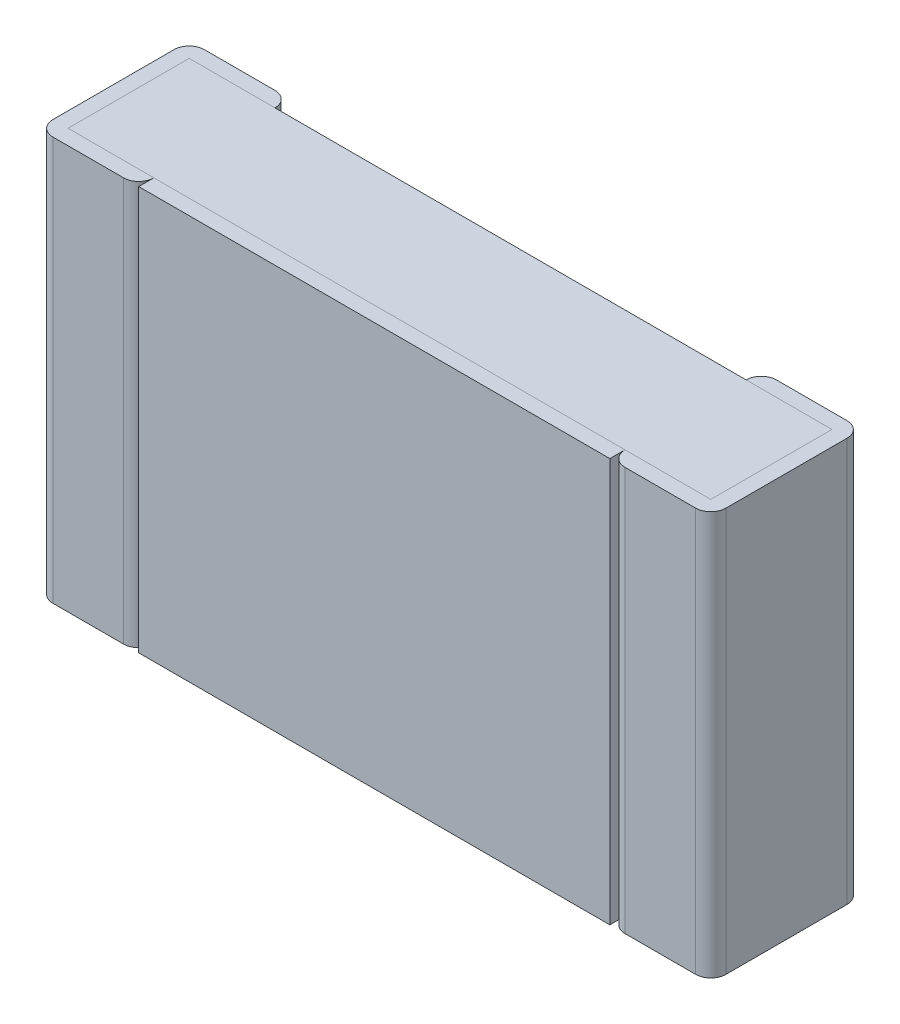
ISO-10303-21;
HEADER;
FILE_DESCRIPTION(('STEP AP214'),'2;1');
FILE_NAME('part.step','',(''),(''),'','','');
FILE_SCHEMA(('AUTOMOTIVE_DESIGN { 1 0 10303 214 1 1 1 1 }'));
ENDSEC;
DATA;
#1=APPLICATION_CONTEXT('core data for automotive mechanical design processes');
#2=APPLICATION_PROTOCOL_DEFINITION('international standard','automotive_design',2000,#1);
#3=PRODUCT_CONTEXT('',#1,'mechanical');
#4=PRODUCT('Part','Part','',(#3));
#5=PRODUCT_RELATED_PRODUCT_CATEGORY('part','',(#4));
#6=PRODUCT_DEFINITION_FORMATION('','',#4);
#7=PRODUCT_DEFINITION_CONTEXT('part definition',#1,'design');
#8=PRODUCT_DEFINITION('design','',#6,#7);
#9=PRODUCT_DEFINITION_SHAPE('','',#8);
#10=(LENGTH_UNIT() NAMED_UNIT(*) SI_UNIT(.MILLI.,.METRE.));
#11=(NAMED_UNIT(*) PLANE_ANGLE_UNIT() SI_UNIT($,.RADIAN.));
#12=(NAMED_UNIT(*) SI_UNIT($,.STERADIAN.) SOLID_ANGLE_UNIT());
#13=UNCERTAINTY_MEASURE_WITH_UNIT(LENGTH_MEASURE(1.E-05),#10,'distance_accuracy_value','');
#14=(GEOMETRIC_REPRESENTATION_CONTEXT(3) GLOBAL_UNCERTAINTY_ASSIGNED_CONTEXT((#13)) GLOBAL_UNIT_ASSIGNED_CONTEXT((#10,
#11,#12)) REPRESENTATION_CONTEXT('',''));
#15=CARTESIAN_POINT('',(0.,0.,0.));
#16=DIRECTION('',(0.,0.,1.));
#17=DIRECTION('',(1.,0.,0.));
#18=AXIS2_PLACEMENT_3D('',#15,#16,#17);
#19=CARTESIAN_POINT('',(-1.,-0.6,0.));
#20=DIRECTION('',(1.,0.,0.));
#21=DIRECTION('',(0.,1.,0.));
#22=AXIS2_PLACEMENT_3D('',#19,#20,#21);
#23=PLANE('',#22);
#24=DIRECTION('',(0.,1.,0.));
#25=VECTOR('',#24,1.);
#26=CARTESIAN_POINT('',(-1.,-0.6,0.405));
#27=LINE('',#26,#25);
#28=CARTESIAN_POINT('',(-1.,-0.6,0.405));
#29=VERTEX_POINT('',#28);
#30=CARTESIAN_POINT('',(-1.,0.6,0.405));
#31=VERTEX_POINT('',#30);
#32=EDGE_CURVE('E11',#29,#31,#27,.T.);
#33=ORIENTED_EDGE('',*,*,#32,.T.);
#34=DIRECTION('',(0.,0.,1.));
#35=VECTOR('',#34,1.);
#36=CARTESIAN_POINT('',(-1.,0.6,0.));
#37=LINE('',#36,#35);
#38=CARTESIAN_POINT('',(-1.,0.6,0.045));
#39=VERTEX_POINT('',#38);
#40=EDGE_CURVE('E41',#39,#31,#37,.T.);
#41=ORIENTED_EDGE('',*,*,#40,.F.);
#42=DIRECTION('',(0.,1.,0.));
#43=VECTOR('',#42,1.);
#44=CARTESIAN_POINT('',(-1.,-0.6,0.045));
#45=LINE('',#44,#43);
#46=CARTESIAN_POINT('',(-1.,-0.6,0.045));
#47=VERTEX_POINT('',#46);
#48=EDGE_CURVE('E122',#47,#39,#45,.T.);
#49=ORIENTED_EDGE('',*,*,#48,.F.);
#50=DIRECTION('',(0.,0.,1.));
#51=VECTOR('',#50,1.);
#52=CARTESIAN_POINT('',(-1.,-0.6,0.));
#53=LINE('',#52,#51);
#54=EDGE_CURVE('E27',#47,#29,#53,.T.);
#55=ORIENTED_EDGE('',*,*,#54,.T.);
#56=EDGE_LOOP('',(#33,#41,#49,#55));
#57=FACE_BOUND('',#56,.T.);
#58=ADVANCED_FACE('F16',(#57),#23,.F.);
#59=CARTESIAN_POINT('',(-1.,-0.6,0.));
#60=DIRECTION('',(0.,1.,0.));
#61=DIRECTION('',(1.,0.,0.));
#62=AXIS2_PLACEMENT_3D('',#59,#60,#61);
#63=PLANE('',#62);
#64=CARTESIAN_POINT('',(-0.745,-0.6,0.045));
#65=DIRECTION('',(0.,1.,0.));
#66=DIRECTION('',(0.,0.,1.));
#67=AXIS2_PLACEMENT_3D('',#64,#65,#66);
#68=CIRCLE('',#67,0.045);
#69=CARTESIAN_POINT('',(-0.7,-0.6,0.045));
#70=VERTEX_POINT('',#69);
#71=CARTESIAN_POINT('',(-0.745,-0.6,0.));
#72=VERTEX_POINT('',#71);
#73=EDGE_CURVE('E370',#70,#72,#68,.T.);
#74=ORIENTED_EDGE('',*,*,#73,.F.);
#75=DIRECTION('',(1.,0.,0.));
#76=VECTOR('',#75,1.);
#77=CARTESIAN_POINT('',(-0.955,-0.6,0.045));
#78=LINE('',#77,#76);
#79=CARTESIAN_POINT('',(-0.955,-0.6,0.045));
#80=VERTEX_POINT('',#79);
#81=EDGE_CURVE('E295',#80,#70,#78,.T.);
#82=ORIENTED_EDGE('',*,*,#81,.F.);
#83=DIRECTION('',(0.,0.,1.));
#84=VECTOR('',#83,1.);
#85=CARTESIAN_POINT('',(-0.955,-0.6,0.045));
#86=LINE('',#85,#84);
#87=CARTESIAN_POINT('',(-0.955,-0.6,0.405));
#88=VERTEX_POINT('',#87);
#89=EDGE_CURVE('E327',#80,#88,#86,.T.);
#90=ORIENTED_EDGE('',*,*,#89,.T.);
#91=DIRECTION('',(1.,0.,0.));
#92=VECTOR('',#91,1.);
#93=CARTESIAN_POINT('',(-0.955,-0.6,0.405));
#94=LINE('',#93,#92);
#95=CARTESIAN_POINT('',(-0.7,-0.6,0.405));
#96=VERTEX_POINT('',#95);
#97=EDGE_CURVE('E273',#88,#96,#94,.T.);
#98=ORIENTED_EDGE('',*,*,#97,.T.);
#99=CARTESIAN_POINT('',(-0.745,-0.6,0.405));
#100=DIRECTION('',(0.,-1.,0.));
#101=DIRECTION('',(0.,0.,1.));
#102=AXIS2_PLACEMENT_3D('',#99,#100,#101);
#103=CIRCLE('',#102,0.045);
#104=CARTESIAN_POINT('',(-0.745,-0.6,0.45));
#105=VERTEX_POINT('',#104);
#106=EDGE_CURVE('E269',#96,#105,#103,.T.);
#107=ORIENTED_EDGE('',*,*,#106,.T.);
#108=DIRECTION('',(1.,0.,0.));
#109=VECTOR('',#108,1.);
#110=CARTESIAN_POINT('',(-1.,-0.6,0.45));
#111=LINE('',#110,#109);
#112=CARTESIAN_POINT('',(-0.955,-0.6,0.45));
#113=VERTEX_POINT('',#112);
#114=EDGE_CURVE('E299',#113,#105,#111,.T.);
#115=ORIENTED_EDGE('',*,*,#114,.F.);
#116=CARTESIAN_POINT('',(-0.955,-0.6,0.405));
#117=DIRECTION('',(0.,1.,0.));
#118=DIRECTION('',(0.,0.,1.));
#119=AXIS2_PLACEMENT_3D('',#116,#117,#118);
#120=CIRCLE('',#119,0.045);
#121=EDGE_CURVE('E289',#29,#113,#120,.T.);
#122=ORIENTED_EDGE('',*,*,#121,.F.);
#123=ORIENTED_EDGE('',*,*,#54,.F.);
#124=CARTESIAN_POINT('',(-0.955,-0.6,0.045));
#125=DIRECTION('',(0.,-1.,0.));
#126=DIRECTION('',(0.,0.,1.));
#127=AXIS2_PLACEMENT_3D('',#124,#125,#126);
#128=CIRCLE('',#127,0.045);
#129=CARTESIAN_POINT('',(-0.955,-0.6,0.));
#130=VERTEX_POINT('',#129);
#131=EDGE_CURVE('E274',#47,#130,#128,.T.);
#132=ORIENTED_EDGE('',*,*,#131,.T.);
#133=DIRECTION('',(1.,0.,0.));
#134=VECTOR('',#133,1.);
#135=CARTESIAN_POINT('',(-1.,-0.6,0.));
#136=LINE('',#135,#134);
#137=EDGE_CURVE('E317',#130,#72,#136,.T.);
#138=ORIENTED_EDGE('',*,*,#137,.T.);
#139=EDGE_LOOP('',(#74,#82,#90,#98,#107,#115,#122,#123,#132,#138));
#140=FACE_BOUND('',#139,.T.);
#141=ADVANCED_FACE('F529',(#140),#63,.F.);
#142=CARTESIAN_POINT('',(-0.955,-0.6,0.045));
#143=DIRECTION('',(0.,1.,0.));
#144=DIRECTION('',(-1.,0.,0.));
#145=AXIS2_PLACEMENT_3D('',#142,#143,#144);
#146=CYLINDRICAL_SURFACE('',#145,0.045);
#147=ORIENTED_EDGE('',*,*,#48,.T.);
#148=CARTESIAN_POINT('',(-0.955,0.6,0.045));
#149=DIRECTION('',(0.,-1.,0.));
#150=DIRECTION('',(0.,0.,1.));
#151=AXIS2_PLACEMENT_3D('',#148,#149,#150);
#152=CIRCLE('',#151,0.045);
#153=CARTESIAN_POINT('',(-0.955,0.6,0.));
#154=VERTEX_POINT('',#153);
#155=EDGE_CURVE('E293',#39,#154,#152,.T.);
#156=ORIENTED_EDGE('',*,*,#155,.T.);
#157=DIRECTION('',(0.,1.,0.));
#158=VECTOR('',#157,1.);
#159=CARTESIAN_POINT('',(-0.955,-0.6,0.));
#160=LINE('',#159,#158);
#161=EDGE_CURVE('E328',#130,#154,#160,.T.);
#162=ORIENTED_EDGE('',*,*,#161,.F.);
#163=ORIENTED_EDGE('',*,*,#131,.F.);
#164=EDGE_LOOP('',(#147,#156,#162,#163));
#165=FACE_BOUND('',#164,.T.);
#166=ADVANCED_FACE('F18',(#165),#146,.T.);
#167=CARTESIAN_POINT('',(-0.955,-0.6,0.405));
#168=DIRECTION('',(0.,1.,0.));
#169=DIRECTION('',(-1.,0.,0.));
#170=AXIS2_PLACEMENT_3D('',#167,#168,#169);
#171=CYLINDRICAL_SURFACE('',#170,0.045);
#172=ORIENTED_EDGE('',*,*,#121,.T.);
#173=DIRECTION('',(0.,1.,0.));
#174=VECTOR('',#173,1.);
#175=CARTESIAN_POINT('',(-0.955,-0.6,0.45));
#176=LINE('',#175,#174);
#177=CARTESIAN_POINT('',(-0.955,0.6,0.45));
#178=VERTEX_POINT('',#177);
#179=EDGE_CURVE('E294',#113,#178,#176,.T.);
#180=ORIENTED_EDGE('',*,*,#179,.T.);
#181=CARTESIAN_POINT('',(-0.955,0.6,0.405));
#182=DIRECTION('',(0.,1.,0.));
#183=DIRECTION('',(0.,0.,1.));
#184=AXIS2_PLACEMENT_3D('',#181,#182,#183);
#185=CIRCLE('',#184,0.045);
#186=EDGE_CURVE('E300',#31,#178,#185,.T.);
#187=ORIENTED_EDGE('',*,*,#186,.F.);
#188=ORIENTED_EDGE('',*,*,#32,.F.);
#189=EDGE_LOOP('',(#172,#180,#187,#188));
#190=FACE_BOUND('',#189,.T.);
#191=ADVANCED_FACE('F532',(#190),#171,.T.);
#192=CARTESIAN_POINT('',(-1.,0.6,0.));
#193=DIRECTION('',(0.,1.,0.));
#194=DIRECTION('',(1.,0.,0.));
#195=AXIS2_PLACEMENT_3D('',#192,#193,#194);
#196=PLANE('',#195);
#197=DIRECTION('',(1.,0.,0.));
#198=VECTOR('',#197,1.);
#199=CARTESIAN_POINT('',(-1.,0.6,0.));
#200=LINE('',#199,#198);
#201=CARTESIAN_POINT('',(-0.745,0.6,0.));
#202=VERTEX_POINT('',#201);
#203=EDGE_CURVE('E333',#154,#202,#200,.T.);
#204=ORIENTED_EDGE('',*,*,#203,.F.);
#205=ORIENTED_EDGE('',*,*,#155,.F.);
#206=ORIENTED_EDGE('',*,*,#40,.T.);
#207=ORIENTED_EDGE('',*,*,#186,.T.);
#208=DIRECTION('',(1.,0.,0.));
#209=VECTOR('',#208,1.);
#210=CARTESIAN_POINT('',(-1.,0.6,0.45));
#211=LINE('',#210,#209);
#212=CARTESIAN_POINT('',(-0.745,0.6,0.45));
#213=VERTEX_POINT('',#212);
#214=EDGE_CURVE('E303',#178,#213,#211,.T.);
#215=ORIENTED_EDGE('',*,*,#214,.T.);
#216=CARTESIAN_POINT('',(-0.745,0.6,0.405));
#217=DIRECTION('',(0.,-1.,0.));
#218=DIRECTION('',(0.,0.,1.));
#219=AXIS2_PLACEMENT_3D('',#216,#217,#218);
#220=CIRCLE('',#219,0.045);
#221=CARTESIAN_POINT('',(-0.7,0.6,0.405));
#222=VERTEX_POINT('',#221);
#223=EDGE_CURVE('E275',#222,#213,#220,.T.);
#224=ORIENTED_EDGE('',*,*,#223,.F.);
#225=DIRECTION('',(1.,0.,0.));
#226=VECTOR('',#225,1.);
#227=CARTESIAN_POINT('',(-0.955,0.6,0.405));
#228=LINE('',#227,#226);
#229=CARTESIAN_POINT('',(-0.955,0.6,0.405));
#230=VERTEX_POINT('',#229);
#231=EDGE_CURVE('E352',#230,#222,#228,.T.);
#232=ORIENTED_EDGE('',*,*,#231,.F.);
#233=DIRECTION('',(0.,0.,1.));
#234=VECTOR('',#233,1.);
#235=CARTESIAN_POINT('',(-0.955,0.6,0.045));
#236=LINE('',#235,#234);
#237=CARTESIAN_POINT('',(-0.955,0.6,0.045));
#238=VERTEX_POINT('',#237);
#239=EDGE_CURVE('E279',#238,#230,#236,.T.);
#240=ORIENTED_EDGE('',*,*,#239,.F.);
#241=DIRECTION('',(1.,0.,0.));
#242=VECTOR('',#241,1.);
#243=CARTESIAN_POINT('',(-0.955,0.6,0.045));
#244=LINE('',#243,#242);
#245=CARTESIAN_POINT('',(-0.7,0.6,0.045));
#246=VERTEX_POINT('',#245);
#247=EDGE_CURVE('E334',#238,#246,#244,.T.);
#248=ORIENTED_EDGE('',*,*,#247,.T.);
#249=CARTESIAN_POINT('',(-0.745,0.6,0.045));
#250=DIRECTION('',(0.,1.,0.));
#251=DIRECTION('',(0.,0.,1.));
#252=AXIS2_PLACEMENT_3D('',#249,#250,#251);
#253=CIRCLE('',#252,0.045);
#254=EDGE_CURVE('E332',#246,#202,#253,.T.);
#255=ORIENTED_EDGE('',*,*,#254,.T.);
#256=EDGE_LOOP('',(#204,#205,#206,#207,#215,#224,#232,#240,#248,#255));
#257=FACE_BOUND('',#256,.T.);
#258=ADVANCED_FACE('F485',(#257),#196,.T.);
#259=CARTESIAN_POINT('',(-1.,-0.6,0.));
#260=DIRECTION('',(0.,0.,1.));
#261=DIRECTION('',(1.,0.,0.));
#262=AXIS2_PLACEMENT_3D('',#259,#260,#261);
#263=PLANE('',#262);
#264=DIRECTION('',(0.,1.,0.));
#265=VECTOR('',#264,1.);
#266=CARTESIAN_POINT('',(-0.745,-0.6,0.));
#267=LINE('',#266,#265);
#268=EDGE_CURVE('E316',#72,#202,#267,.T.);
#269=ORIENTED_EDGE('',*,*,#268,.F.);
#270=ORIENTED_EDGE('',*,*,#137,.F.);
#271=ORIENTED_EDGE('',*,*,#161,.T.);
#272=ORIENTED_EDGE('',*,*,#203,.T.);
#273=EDGE_LOOP('',(#269,#270,#271,#272));
#274=FACE_BOUND('',#273,.T.);
#275=ADVANCED_FACE('F524',(#274),#263,.F.);
#276=CARTESIAN_POINT('',(-0.745,-0.6,0.045));
#277=DIRECTION('',(0.,1.,0.));
#278=DIRECTION('',(1.,0.,0.));
#279=AXIS2_PLACEMENT_3D('',#276,#277,#278);
#280=CYLINDRICAL_SURFACE('',#279,0.045);
#281=ORIENTED_EDGE('',*,*,#73,.T.);
#282=ORIENTED_EDGE('',*,*,#268,.T.);
#283=ORIENTED_EDGE('',*,*,#254,.F.);
#284=DIRECTION('',(0.,1.,0.));
#285=VECTOR('',#284,1.);
#286=CARTESIAN_POINT('',(-0.7,-0.6,0.045));
#287=LINE('',#286,#285);
#288=EDGE_CURVE('E338',#70,#246,#287,.T.);
#289=ORIENTED_EDGE('',*,*,#288,.F.);
#290=EDGE_LOOP('',(#281,#282,#283,#289));
#291=FACE_BOUND('',#290,.T.);
#292=ADVANCED_FACE('F521',(#291),#280,.T.);
#293=CARTESIAN_POINT('',(-0.955,-0.6,0.045));
#294=DIRECTION('',(0.,1.,0.));
#295=DIRECTION('',(1.,0.,0.));
#296=AXIS2_PLACEMENT_3D('',#293,#294,#295);
#297=PLANE('',#296);
#298=DIRECTION('',(1.,0.,0.));
#299=VECTOR('',#298,1.);
#300=CARTESIAN_POINT('',(-0.955,-0.6,0.045));
#301=LINE('',#300,#299);
#302=CARTESIAN_POINT('',(0.7,-0.6,0.045));
#303=VERTEX_POINT('',#302);
#304=EDGE_CURVE('E313',#70,#303,#301,.T.);
#305=ORIENTED_EDGE('',*,*,#304,.T.);
#306=DIRECTION('',(1.,0.,0.));
#307=VECTOR('',#306,1.);
#308=CARTESIAN_POINT('',(-0.955,-0.6,0.045));
#309=LINE('',#308,#307);
#310=CARTESIAN_POINT('',(0.955,-0.6,0.045));
#311=VERTEX_POINT('',#310);
#312=EDGE_CURVE('E306',#303,#311,#309,.T.);
#313=ORIENTED_EDGE('',*,*,#312,.T.);
#314=DIRECTION('',(0.,0.,1.));
#315=VECTOR('',#314,1.);
#316=CARTESIAN_POINT('',(0.955,-0.6,0.045));
#317=LINE('',#316,#315);
#318=CARTESIAN_POINT('',(0.955,-0.6,0.405));
#319=VERTEX_POINT('',#318);
#320=EDGE_CURVE('E240',#311,#319,#317,.T.);
#321=ORIENTED_EDGE('',*,*,#320,.T.);
#322=DIRECTION('',(1.,0.,0.));
#323=VECTOR('',#322,1.);
#324=CARTESIAN_POINT('',(-0.955,-0.6,0.405));
#325=LINE('',#324,#323);
#326=CARTESIAN_POINT('',(0.7,-0.6,0.405));
#327=VERTEX_POINT('',#326);
#328=EDGE_CURVE('E207',#327,#319,#325,.T.);
#329=ORIENTED_EDGE('',*,*,#328,.F.);
#330=DIRECTION('',(1.,0.,0.));
#331=VECTOR('',#330,1.);
#332=CARTESIAN_POINT('',(-0.7,-0.6,0.405));
#333=LINE('',#332,#331);
#334=EDGE_CURVE('E215',#96,#327,#333,.T.);
#335=ORIENTED_EDGE('',*,*,#334,.F.);
#336=ORIENTED_EDGE('',*,*,#97,.F.);
#337=ORIENTED_EDGE('',*,*,#89,.F.);
#338=ORIENTED_EDGE('',*,*,#81,.T.);
#339=EDGE_LOOP('',(#305,#313,#321,#329,#335,#336,#337,#338));
#340=FACE_BOUND('',#339,.T.);
#341=ADVANCED_FACE('F239',(#340),#297,.F.);
#342=CARTESIAN_POINT('',(-1.,-0.6,0.45));
#343=DIRECTION('',(0.,0.,1.));
#344=DIRECTION('',(1.,0.,0.));
#345=AXIS2_PLACEMENT_3D('',#342,#343,#344);
#346=PLANE('',#345);
#347=ORIENTED_EDGE('',*,*,#214,.F.);
#348=ORIENTED_EDGE('',*,*,#179,.F.);
#349=ORIENTED_EDGE('',*,*,#114,.T.);
#350=DIRECTION('',(0.,1.,0.));
#351=VECTOR('',#350,1.);
#352=CARTESIAN_POINT('',(-0.745,-0.6,0.45));
#353=LINE('',#352,#351);
#354=EDGE_CURVE('E452',#105,#213,#353,.T.);
#355=ORIENTED_EDGE('',*,*,#354,.T.);
#356=EDGE_LOOP('',(#347,#348,#349,#355));
#357=FACE_BOUND('',#356,.T.);
#358=ADVANCED_FACE('F488',(#357),#346,.T.);
#359=CARTESIAN_POINT('',(-0.745,-0.6,0.405));
#360=DIRECTION('',(0.,1.,0.));
#361=DIRECTION('',(1.,0.,0.));
#362=AXIS2_PLACEMENT_3D('',#359,#360,#361);
#363=CYLINDRICAL_SURFACE('',#362,0.045);
#364=DIRECTION('',(0.,1.,0.));
#365=VECTOR('',#364,1.);
#366=CARTESIAN_POINT('',(-0.7,-0.6,0.405));
#367=LINE('',#366,#365);
#368=EDGE_CURVE('E278',#96,#222,#367,.T.);
#369=ORIENTED_EDGE('',*,*,#368,.T.);
#370=ORIENTED_EDGE('',*,*,#223,.T.);
#371=ORIENTED_EDGE('',*,*,#354,.F.);
#372=ORIENTED_EDGE('',*,*,#106,.F.);
#373=EDGE_LOOP('',(#369,#370,#371,#372));
#374=FACE_BOUND('',#373,.T.);
#375=ADVANCED_FACE('F467',(#374),#363,.T.);
#376=CARTESIAN_POINT('',(-0.955,0.6,0.045));
#377=DIRECTION('',(0.,1.,0.));
#378=DIRECTION('',(1.,0.,0.));
#379=AXIS2_PLACEMENT_3D('',#376,#377,#378);
#380=PLANE('',#379);
#381=ORIENTED_EDGE('',*,*,#247,.F.);
#382=ORIENTED_EDGE('',*,*,#239,.T.);
#383=ORIENTED_EDGE('',*,*,#231,.T.);
#384=DIRECTION('',(1.,0.,0.));
#385=VECTOR('',#384,1.);
#386=CARTESIAN_POINT('',(-0.7,0.6,0.405));
#387=LINE('',#386,#385);
#388=CARTESIAN_POINT('',(0.7,0.6,0.405));
#389=VERTEX_POINT('',#388);
#390=EDGE_CURVE('E356',#222,#389,#387,.T.);
#391=ORIENTED_EDGE('',*,*,#390,.T.);
#392=DIRECTION('',(1.,0.,0.));
#393=VECTOR('',#392,1.);
#394=CARTESIAN_POINT('',(-0.955,0.6,0.405));
#395=LINE('',#394,#393);
#396=CARTESIAN_POINT('',(0.955,0.6,0.405));
#397=VERTEX_POINT('',#396);
#398=EDGE_CURVE('E445',#389,#397,#395,.T.);
#399=ORIENTED_EDGE('',*,*,#398,.T.);
#400=DIRECTION('',(0.,0.,1.));
#401=VECTOR('',#400,1.);
#402=CARTESIAN_POINT('',(0.955,0.6,0.045));
#403=LINE('',#402,#401);
#404=CARTESIAN_POINT('',(0.955,0.6,0.045));
#405=VERTEX_POINT('',#404);
#406=EDGE_CURVE('E397',#405,#397,#403,.T.);
#407=ORIENTED_EDGE('',*,*,#406,.F.);
#408=DIRECTION('',(1.,0.,0.));
#409=VECTOR('',#408,1.);
#410=CARTESIAN_POINT('',(-0.955,0.6,0.045));
#411=LINE('',#410,#409);
#412=CARTESIAN_POINT('',(0.7,0.6,0.045));
#413=VERTEX_POINT('',#412);
#414=EDGE_CURVE('E345',#413,#405,#411,.T.);
#415=ORIENTED_EDGE('',*,*,#414,.F.);
#416=DIRECTION('',(1.,0.,0.));
#417=VECTOR('',#416,1.);
#418=CARTESIAN_POINT('',(-0.955,0.6,0.045));
#419=LINE('',#418,#417);
#420=EDGE_CURVE('E341',#246,#413,#419,.T.);
#421=ORIENTED_EDGE('',*,*,#420,.F.);
#422=EDGE_LOOP('',(#381,#382,#383,#391,#399,#407,#415,#421));
#423=FACE_BOUND('',#422,.T.);
#424=ADVANCED_FACE('F483',(#423),#380,.T.);
#425=CARTESIAN_POINT('',(-0.955,-0.6,0.045));
#426=DIRECTION('',(0.,0.,1.));
#427=DIRECTION('',(1.,0.,0.));
#428=AXIS2_PLACEMENT_3D('',#425,#426,#427);
#429=PLANE('',#428);
#430=ORIENTED_EDGE('',*,*,#420,.T.);
#431=DIRECTION('',(0.,1.,0.));
#432=VECTOR('',#431,1.);
#433=CARTESIAN_POINT('',(0.7,-0.6,0.045));
#434=LINE('',#433,#432);
#435=EDGE_CURVE('E268',#303,#413,#434,.T.);
#436=ORIENTED_EDGE('',*,*,#435,.F.);
#437=ORIENTED_EDGE('',*,*,#304,.F.);
#438=ORIENTED_EDGE('',*,*,#288,.T.);
#439=EDGE_LOOP('',(#430,#436,#437,#438));
#440=FACE_BOUND('',#439,.T.);
#441=ADVANCED_FACE('F558',(#440),#429,.F.);
#442=CARTESIAN_POINT('',(0.7,-0.6,0.));
#443=DIRECTION('',(0.,1.,0.));
#444=DIRECTION('',(1.,0.,0.));
#445=AXIS2_PLACEMENT_3D('',#442,#443,#444);
#446=PLANE('',#445);
#447=CARTESIAN_POINT('',(0.955,-0.6,0.045));
#448=DIRECTION('',(0.,1.,0.));
#449=DIRECTION('',(0.,0.,1.));
#450=AXIS2_PLACEMENT_3D('',#447,#448,#449);
#451=CIRCLE('',#450,0.045);
#452=CARTESIAN_POINT('',(1.,-0.6,0.045));
#453=VERTEX_POINT('',#452);
#454=CARTESIAN_POINT('',(0.955,-0.6,0.));
#455=VERTEX_POINT('',#454);
#456=EDGE_CURVE('E324',#453,#455,#451,.T.);
#457=ORIENTED_EDGE('',*,*,#456,.F.);
#458=DIRECTION('',(0.,0.,1.));
#459=VECTOR('',#458,1.);
#460=CARTESIAN_POINT('',(1.,-0.6,0.));
#461=LINE('',#460,#459);
#462=CARTESIAN_POINT('',(1.,-0.6,0.405));
#463=VERTEX_POINT('',#462);
#464=EDGE_CURVE('E342',#453,#463,#461,.T.);
#465=ORIENTED_EDGE('',*,*,#464,.T.);
#466=CARTESIAN_POINT('',(0.955,-0.6,0.405));
#467=DIRECTION('',(0.,-1.,0.));
#468=DIRECTION('',(0.,0.,1.));
#469=AXIS2_PLACEMENT_3D('',#466,#467,#468);
#470=CIRCLE('',#469,0.045);
#471=CARTESIAN_POINT('',(0.955,-0.6,0.45));
#472=VERTEX_POINT('',#471);
#473=EDGE_CURVE('E242',#463,#472,#470,.T.);
#474=ORIENTED_EDGE('',*,*,#473,.T.);
#475=DIRECTION('',(1.,0.,0.));
#476=VECTOR('',#475,1.);
#477=CARTESIAN_POINT('',(0.7,-0.6,0.45));
#478=LINE('',#477,#476);
#479=CARTESIAN_POINT('',(0.745,-0.6,0.45));
#480=VERTEX_POINT('',#479);
#481=EDGE_CURVE('E20',#480,#472,#478,.T.);
#482=ORIENTED_EDGE('',*,*,#481,.F.);
#483=CARTESIAN_POINT('',(0.745,-0.6,0.405));
#484=DIRECTION('',(0.,1.,0.));
#485=DIRECTION('',(0.,0.,1.));
#486=AXIS2_PLACEMENT_3D('',#483,#484,#485);
#487=CIRCLE('',#486,0.045);
#488=EDGE_CURVE('E186',#327,#480,#487,.T.);
#489=ORIENTED_EDGE('',*,*,#488,.F.);
#490=ORIENTED_EDGE('',*,*,#328,.T.);
#491=ORIENTED_EDGE('',*,*,#320,.F.);
#492=ORIENTED_EDGE('',*,*,#312,.F.);
#493=CARTESIAN_POINT('',(0.745,-0.6,0.045));
#494=DIRECTION('',(0.,-1.,0.));
#495=DIRECTION('',(0.,0.,1.));
#496=AXIS2_PLACEMENT_3D('',#493,#494,#495);
#497=CIRCLE('',#496,0.045);
#498=CARTESIAN_POINT('',(0.745,-0.6,0.));
#499=VERTEX_POINT('',#498);
#500=EDGE_CURVE('E243',#303,#499,#497,.T.);
#501=ORIENTED_EDGE('',*,*,#500,.T.);
#502=DIRECTION('',(1.,0.,0.));
#503=VECTOR('',#502,1.);
#504=CARTESIAN_POINT('',(0.7,-0.6,0.));
#505=LINE('',#504,#503);
#506=EDGE_CURVE('E236',#499,#455,#505,.T.);
#507=ORIENTED_EDGE('',*,*,#506,.T.);
#508=EDGE_LOOP('',(#457,#465,#474,#482,#489,#490,#491,#492,#501,#507));
#509=FACE_BOUND('',#508,.T.);
#510=ADVANCED_FACE('F204',(#509),#446,.F.);
#511=CARTESIAN_POINT('',(-0.7,-0.6,0.405));
#512=DIRECTION('',(0.,1.,0.));
#513=DIRECTION('',(1.,0.,0.));
#514=AXIS2_PLACEMENT_3D('',#511,#512,#513);
#515=PLANE('',#514);
#516=DIRECTION('',(0.,0.,1.));
#517=VECTOR('',#516,1.);
#518=CARTESIAN_POINT('',(0.7,-0.6,0.405));
#519=LINE('',#518,#517);
#520=CARTESIAN_POINT('',(0.7,-0.6,0.45));
#521=VERTEX_POINT('',#520);
#522=EDGE_CURVE('E218',#327,#521,#519,.T.);
#523=ORIENTED_EDGE('',*,*,#522,.T.);
#524=DIRECTION('',(1.,0.,0.));
#525=VECTOR('',#524,1.);
#526=CARTESIAN_POINT('',(-0.7,-0.6,0.45));
#527=LINE('',#526,#525);
#528=CARTESIAN_POINT('',(-0.7,-0.6,0.45));
#529=VERTEX_POINT('',#528);
#530=EDGE_CURVE('E258',#529,#521,#527,.T.);
#531=ORIENTED_EDGE('',*,*,#530,.F.);
#532=DIRECTION('',(0.,0.,1.));
#533=VECTOR('',#532,1.);
#534=CARTESIAN_POINT('',(-0.7,-0.6,0.405));
#535=LINE('',#534,#533);
#536=EDGE_CURVE('E221',#96,#529,#535,.T.);
#537=ORIENTED_EDGE('',*,*,#536,.F.);
#538=ORIENTED_EDGE('',*,*,#334,.T.);
#539=EDGE_LOOP('',(#523,#531,#537,#538));
#540=FACE_BOUND('',#539,.T.);
#541=ADVANCED_FACE('F217',(#540),#515,.F.);
#542=CARTESIAN_POINT('',(-0.7,-0.6,0.405));
#543=DIRECTION('',(1.,0.,0.));
#544=DIRECTION('',(0.,1.,0.));
#545=AXIS2_PLACEMENT_3D('',#542,#543,#544);
#546=PLANE('',#545);
#547=DIRECTION('',(0.,1.,0.));
#548=VECTOR('',#547,1.);
#549=CARTESIAN_POINT('',(-0.7,-0.6,0.45));
#550=LINE('',#549,#548);
#551=CARTESIAN_POINT('',(-0.7,0.6,0.45));
#552=VERTEX_POINT('',#551);
#553=EDGE_CURVE('E226',#529,#552,#550,.T.);
#554=ORIENTED_EDGE('',*,*,#553,.T.);
#555=DIRECTION('',(0.,0.,1.));
#556=VECTOR('',#555,1.);
#557=CARTESIAN_POINT('',(-0.7,0.6,0.405));
#558=LINE('',#557,#556);
#559=EDGE_CURVE('E267',#222,#552,#558,.T.);
#560=ORIENTED_EDGE('',*,*,#559,.F.);
#561=ORIENTED_EDGE('',*,*,#368,.F.);
#562=ORIENTED_EDGE('',*,*,#536,.T.);
#563=EDGE_LOOP('',(#554,#560,#561,#562));
#564=FACE_BOUND('',#563,.T.);
#565=ADVANCED_FACE('F473',(#564),#546,.F.);
#566=CARTESIAN_POINT('',(0.7,0.6,0.));
#567=DIRECTION('',(0.,1.,0.));
#568=DIRECTION('',(1.,0.,0.));
#569=AXIS2_PLACEMENT_3D('',#566,#567,#568);
#570=PLANE('',#569);
#571=DIRECTION('',(1.,0.,0.));
#572=VECTOR('',#571,1.);
#573=CARTESIAN_POINT('',(0.7,0.6,0.));
#574=LINE('',#573,#572);
#575=CARTESIAN_POINT('',(0.745,0.6,0.));
#576=VERTEX_POINT('',#575);
#577=CARTESIAN_POINT('',(0.955,0.6,0.));
#578=VERTEX_POINT('',#577);
#579=EDGE_CURVE('E285',#576,#578,#574,.T.);
#580=ORIENTED_EDGE('',*,*,#579,.F.);
#581=CARTESIAN_POINT('',(0.745,0.6,0.045));
#582=DIRECTION('',(0.,-1.,0.));
#583=DIRECTION('',(0.,0.,1.));
#584=AXIS2_PLACEMENT_3D('',#581,#582,#583);
#585=CIRCLE('',#584,0.045);
#586=EDGE_CURVE('E284',#413,#576,#585,.T.);
#587=ORIENTED_EDGE('',*,*,#586,.F.);
#588=ORIENTED_EDGE('',*,*,#414,.T.);
#589=ORIENTED_EDGE('',*,*,#406,.T.);
#590=ORIENTED_EDGE('',*,*,#398,.F.);
#591=CARTESIAN_POINT('',(0.745,0.6,0.405));
#592=DIRECTION('',(0.,1.,0.));
#593=DIRECTION('',(0.,0.,1.));
#594=AXIS2_PLACEMENT_3D('',#591,#592,#593);
#595=CIRCLE('',#594,0.045);
#596=CARTESIAN_POINT('',(0.745,0.6,0.45));
#597=VERTEX_POINT('',#596);
#598=EDGE_CURVE('E248',#389,#597,#595,.T.);
#599=ORIENTED_EDGE('',*,*,#598,.T.);
#600=DIRECTION('',(1.,0.,0.));
#601=VECTOR('',#600,1.);
#602=CARTESIAN_POINT('',(0.7,0.6,0.45));
#603=LINE('',#602,#601);
#604=CARTESIAN_POINT('',(0.955,0.6,0.45));
#605=VERTEX_POINT('',#604);
#606=EDGE_CURVE('E393',#597,#605,#603,.T.);
#607=ORIENTED_EDGE('',*,*,#606,.T.);
#608=CARTESIAN_POINT('',(0.955,0.6,0.405));
#609=DIRECTION('',(0.,-1.,0.));
#610=DIRECTION('',(0.,0.,1.));
#611=AXIS2_PLACEMENT_3D('',#608,#609,#610);
#612=CIRCLE('',#611,0.045);
#613=CARTESIAN_POINT('',(1.,0.6,0.405));
#614=VERTEX_POINT('',#613);
#615=EDGE_CURVE('E451',#614,#605,#612,.T.);
#616=ORIENTED_EDGE('',*,*,#615,.F.);
#617=DIRECTION('',(0.,0.,1.));
#618=VECTOR('',#617,1.);
#619=CARTESIAN_POINT('',(1.,0.6,0.));
#620=LINE('',#619,#618);
#621=CARTESIAN_POINT('',(1.,0.6,0.045));
#622=VERTEX_POINT('',#621);
#623=EDGE_CURVE('E312',#622,#614,#620,.T.);
#624=ORIENTED_EDGE('',*,*,#623,.F.);
#625=CARTESIAN_POINT('',(0.955,0.6,0.045));
#626=DIRECTION('',(0.,1.,0.));
#627=DIRECTION('',(0.,0.,1.));
#628=AXIS2_PLACEMENT_3D('',#625,#626,#627);
#629=CIRCLE('',#628,0.045);
#630=EDGE_CURVE('E379',#622,#578,#629,.T.);
#631=ORIENTED_EDGE('',*,*,#630,.T.);
#632=EDGE_LOOP('',(#580,#587,#588,#589,#590,#599,#607,#616,#624,#631));
#633=FACE_BOUND('',#632,.T.);
#634=ADVANCED_FACE('F416',(#633),#570,.T.);
#635=CARTESIAN_POINT('',(-0.7,0.6,0.405));
#636=DIRECTION('',(0.,1.,0.));
#637=DIRECTION('',(1.,0.,0.));
#638=AXIS2_PLACEMENT_3D('',#635,#636,#637);
#639=PLANE('',#638);
#640=ORIENTED_EDGE('',*,*,#390,.F.);
#641=ORIENTED_EDGE('',*,*,#559,.T.);
#642=DIRECTION('',(1.,0.,0.));
#643=VECTOR('',#642,1.);
#644=CARTESIAN_POINT('',(-0.7,0.6,0.45));
#645=LINE('',#644,#643);
#646=CARTESIAN_POINT('',(0.7,0.6,0.45));
#647=VERTEX_POINT('',#646);
#648=EDGE_CURVE('E263',#552,#647,#645,.T.);
#649=ORIENTED_EDGE('',*,*,#648,.T.);
#650=DIRECTION('',(0.,0.,1.));
#651=VECTOR('',#650,1.);
#652=CARTESIAN_POINT('',(0.7,0.6,0.405));
#653=LINE('',#652,#651);
#654=EDGE_CURVE('E251',#389,#647,#653,.T.);
#655=ORIENTED_EDGE('',*,*,#654,.F.);
#656=EDGE_LOOP('',(#640,#641,#649,#655));
#657=FACE_BOUND('',#656,.T.);
#658=ADVANCED_FACE('F477',(#657),#639,.T.);
#659=CARTESIAN_POINT('',(0.745,-0.6,0.045));
#660=DIRECTION('',(0.,1.,0.));
#661=DIRECTION('',(-1.,0.,0.));
#662=AXIS2_PLACEMENT_3D('',#659,#660,#661);
#663=CYLINDRICAL_SURFACE('',#662,0.045);
#664=ORIENTED_EDGE('',*,*,#435,.T.);
#665=ORIENTED_EDGE('',*,*,#586,.T.);
#666=DIRECTION('',(0.,1.,0.));
#667=VECTOR('',#666,1.);
#668=CARTESIAN_POINT('',(0.745,-0.6,0.));
#669=LINE('',#668,#667);
#670=EDGE_CURVE('E280',#499,#576,#669,.T.);
#671=ORIENTED_EDGE('',*,*,#670,.F.);
#672=ORIENTED_EDGE('',*,*,#500,.F.);
#673=EDGE_LOOP('',(#664,#665,#671,#672));
#674=FACE_BOUND('',#673,.T.);
#675=ADVANCED_FACE('F426',(#674),#663,.T.);
#676=CARTESIAN_POINT('',(0.7,-0.6,0.));
#677=DIRECTION('',(0.,0.,1.));
#678=DIRECTION('',(1.,0.,0.));
#679=AXIS2_PLACEMENT_3D('',#676,#677,#678);
#680=PLANE('',#679);
#681=DIRECTION('',(0.,1.,0.));
#682=VECTOR('',#681,1.);
#683=CARTESIAN_POINT('',(0.955,-0.6,0.));
#684=LINE('',#683,#682);
#685=EDGE_CURVE('E311',#455,#578,#684,.T.);
#686=ORIENTED_EDGE('',*,*,#685,.F.);
#687=ORIENTED_EDGE('',*,*,#506,.F.);
#688=ORIENTED_EDGE('',*,*,#670,.T.);
#689=ORIENTED_EDGE('',*,*,#579,.T.);
#690=EDGE_LOOP('',(#686,#687,#688,#689));
#691=FACE_BOUND('',#690,.T.);
#692=ADVANCED_FACE('F411',(#691),#680,.F.);
#693=CARTESIAN_POINT('',(0.955,-0.6,0.045));
#694=DIRECTION('',(0.,1.,0.));
#695=DIRECTION('',(1.,0.,0.));
#696=AXIS2_PLACEMENT_3D('',#693,#694,#695);
#697=CYLINDRICAL_SURFACE('',#696,0.045);
#698=ORIENTED_EDGE('',*,*,#456,.T.);
#699=ORIENTED_EDGE('',*,*,#685,.T.);
#700=ORIENTED_EDGE('',*,*,#630,.F.);
#701=DIRECTION('',(0.,1.,0.));
#702=VECTOR('',#701,1.);
#703=CARTESIAN_POINT('',(1.,-0.6,0.045));
#704=LINE('',#703,#702);
#705=EDGE_CURVE('E307',#453,#622,#704,.T.);
#706=ORIENTED_EDGE('',*,*,#705,.F.);
#707=EDGE_LOOP('',(#698,#699,#700,#706));
#708=FACE_BOUND('',#707,.T.);
#709=ADVANCED_FACE('F421',(#708),#697,.T.);
#710=CARTESIAN_POINT('',(1.,-0.6,0.));
#711=DIRECTION('',(1.,0.,0.));
#712=DIRECTION('',(0.,1.,0.));
#713=AXIS2_PLACEMENT_3D('',#710,#711,#712);
#714=PLANE('',#713);
#715=ORIENTED_EDGE('',*,*,#464,.F.);
#716=ORIENTED_EDGE('',*,*,#705,.T.);
#717=ORIENTED_EDGE('',*,*,#623,.T.);
#718=DIRECTION('',(0.,1.,0.));
#719=VECTOR('',#718,1.);
#720=CARTESIAN_POINT('',(1.,-0.6,0.405));
#721=LINE('',#720,#719);
#722=EDGE_CURVE('E448',#463,#614,#721,.T.);
#723=ORIENTED_EDGE('',*,*,#722,.F.);
#724=EDGE_LOOP('',(#715,#716,#717,#723));
#725=FACE_BOUND('',#724,.T.);
#726=ADVANCED_FACE('F570',(#725),#714,.T.);
#727=CARTESIAN_POINT('',(0.955,-0.6,0.405));
#728=DIRECTION('',(0.,1.,0.));
#729=DIRECTION('',(1.,0.,0.));
#730=AXIS2_PLACEMENT_3D('',#727,#728,#729);
#731=CYLINDRICAL_SURFACE('',#730,0.045);
#732=ORIENTED_EDGE('',*,*,#722,.T.);
#733=ORIENTED_EDGE('',*,*,#615,.T.);
#734=DIRECTION('',(0.,1.,0.));
#735=VECTOR('',#734,1.);
#736=CARTESIAN_POINT('',(0.955,-0.6,0.45));
#737=LINE('',#736,#735);
#738=EDGE_CURVE('E209',#472,#605,#737,.T.);
#739=ORIENTED_EDGE('',*,*,#738,.F.);
#740=ORIENTED_EDGE('',*,*,#473,.F.);
#741=EDGE_LOOP('',(#732,#733,#739,#740));
#742=FACE_BOUND('',#741,.T.);
#743=ADVANCED_FACE('F557',(#742),#731,.T.);
#744=CARTESIAN_POINT('',(0.7,-0.6,0.45));
#745=DIRECTION('',(0.,0.,1.));
#746=DIRECTION('',(1.,0.,0.));
#747=AXIS2_PLACEMENT_3D('',#744,#745,#746);
#748=PLANE('',#747);
#749=ORIENTED_EDGE('',*,*,#606,.F.);
#750=DIRECTION('',(0.,1.,0.));
#751=VECTOR('',#750,1.);
#752=CARTESIAN_POINT('',(0.745,-0.6,0.45));
#753=LINE('',#752,#751);
#754=EDGE_CURVE('E210',#480,#597,#753,.T.);
#755=ORIENTED_EDGE('',*,*,#754,.F.);
#756=ORIENTED_EDGE('',*,*,#481,.T.);
#757=ORIENTED_EDGE('',*,*,#738,.T.);
#758=EDGE_LOOP('',(#749,#755,#756,#757));
#759=FACE_BOUND('',#758,.T.);
#760=ADVANCED_FACE('F554',(#759),#748,.T.);
#761=CARTESIAN_POINT('',(0.745,-0.6,0.405));
#762=DIRECTION('',(0.,1.,0.));
#763=DIRECTION('',(-1.,0.,0.));
#764=AXIS2_PLACEMENT_3D('',#761,#762,#763);
#765=CYLINDRICAL_SURFACE('',#764,0.045);
#766=ORIENTED_EDGE('',*,*,#488,.T.);
#767=ORIENTED_EDGE('',*,*,#754,.T.);
#768=ORIENTED_EDGE('',*,*,#598,.F.);
#769=DIRECTION('',(0.,1.,0.));
#770=VECTOR('',#769,1.);
#771=CARTESIAN_POINT('',(0.7,-0.6,0.405));
#772=LINE('',#771,#770);
#773=EDGE_CURVE('E232',#327,#389,#772,.T.);
#774=ORIENTED_EDGE('',*,*,#773,.F.);
#775=EDGE_LOOP('',(#766,#767,#768,#774));
#776=FACE_BOUND('',#775,.T.);
#777=ADVANCED_FACE('F246',(#776),#765,.T.);
#778=CARTESIAN_POINT('',(0.7,-0.6,0.405));
#779=DIRECTION('',(1.,0.,0.));
#780=DIRECTION('',(0.,1.,0.));
#781=AXIS2_PLACEMENT_3D('',#778,#779,#780);
#782=PLANE('',#781);
#783=ORIENTED_EDGE('',*,*,#522,.F.);
#784=ORIENTED_EDGE('',*,*,#773,.T.);
#785=ORIENTED_EDGE('',*,*,#654,.T.);
#786=DIRECTION('',(0.,1.,0.));
#787=VECTOR('',#786,1.);
#788=CARTESIAN_POINT('',(0.7,-0.6,0.45));
#789=LINE('',#788,#787);
#790=EDGE_CURVE('E234',#521,#647,#789,.T.);
#791=ORIENTED_EDGE('',*,*,#790,.F.);
#792=EDGE_LOOP('',(#783,#784,#785,#791));
#793=FACE_BOUND('',#792,.T.);
#794=ADVANCED_FACE('F230',(#793),#782,.T.);
#795=CARTESIAN_POINT('',(-0.7,-0.6,0.45));
#796=DIRECTION('',(0.,0.,1.));
#797=DIRECTION('',(1.,0.,0.));
#798=AXIS2_PLACEMENT_3D('',#795,#796,#797);
#799=PLANE('',#798);
#800=ORIENTED_EDGE('',*,*,#553,.F.);
#801=ORIENTED_EDGE('',*,*,#530,.T.);
#802=ORIENTED_EDGE('',*,*,#790,.T.);
#803=ORIENTED_EDGE('',*,*,#648,.F.);
#804=EDGE_LOOP('',(#800,#801,#802,#803));
#805=FACE_BOUND('',#804,.T.);
#806=ADVANCED_FACE('F509',(#805),#799,.T.);
#807=CLOSED_SHELL('',(#58,#141,#166,#191,#258,#275,#292,#341,#358,#375,#424,#441,#510,#541,#565,
#634,#658,#675,#692,#709,#726,#743,#760,#777,#794,#806));
#808=MANIFOLD_SOLID_BREP('B1',#807);
#809=ADVANCED_BREP_SHAPE_REPRESENTATION('',(#18,#808),#14);
#810=SHAPE_DEFINITION_REPRESENTATION(#9,#809);
ENDSEC;
END-ISO-10303-21;
